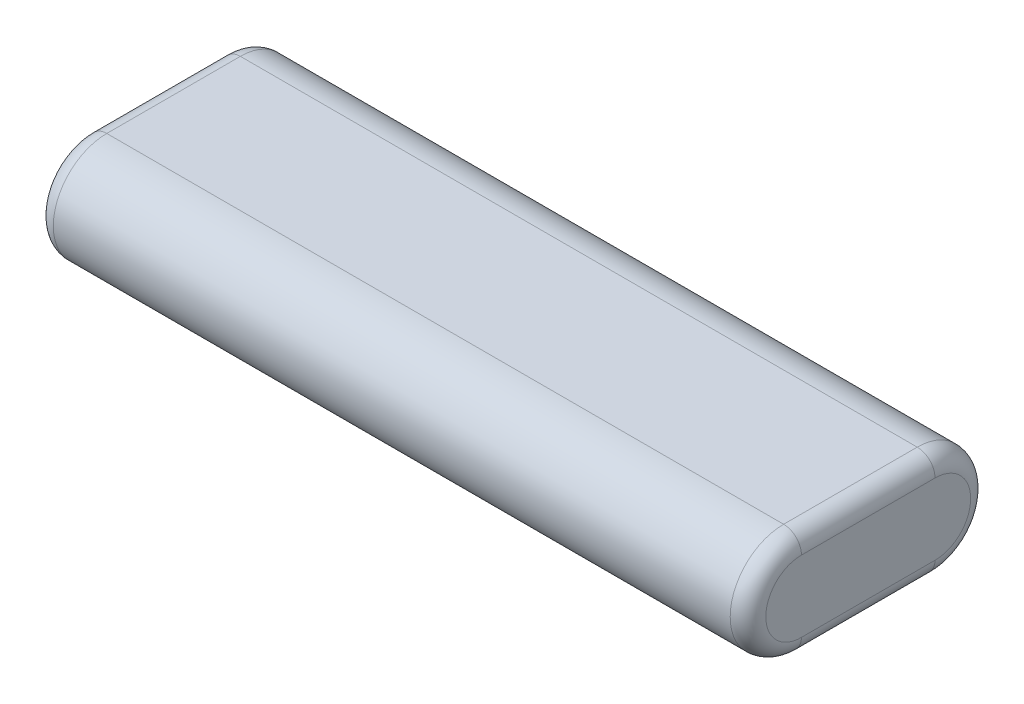
ISO-10303-21;
HEADER;
FILE_DESCRIPTION(('STEP AP214'),'2;1');
FILE_NAME('part.step','',(''),(''),'','','');
FILE_SCHEMA(('AUTOMOTIVE_DESIGN { 1 0 10303 214 1 1 1 1 }'));
ENDSEC;
DATA;
#1=APPLICATION_CONTEXT('core data for automotive mechanical design processes');
#2=APPLICATION_PROTOCOL_DEFINITION('international standard','automotive_design',2000,#1);
#3=PRODUCT_CONTEXT('',#1,'mechanical');
#4=PRODUCT('Part','Part','',(#3));
#5=PRODUCT_RELATED_PRODUCT_CATEGORY('part','',(#4));
#6=PRODUCT_DEFINITION_FORMATION('','',#4);
#7=PRODUCT_DEFINITION_CONTEXT('part definition',#1,'design');
#8=PRODUCT_DEFINITION('design','',#6,#7);
#9=PRODUCT_DEFINITION_SHAPE('','',#8);
#10=(LENGTH_UNIT() NAMED_UNIT(*) SI_UNIT(.MILLI.,.METRE.));
#11=(NAMED_UNIT(*) PLANE_ANGLE_UNIT() SI_UNIT($,.RADIAN.));
#12=(NAMED_UNIT(*) SI_UNIT($,.STERADIAN.) SOLID_ANGLE_UNIT());
#13=UNCERTAINTY_MEASURE_WITH_UNIT(LENGTH_MEASURE(1.E-05),#10,'distance_accuracy_value','');
#14=(GEOMETRIC_REPRESENTATION_CONTEXT(3) GLOBAL_UNCERTAINTY_ASSIGNED_CONTEXT((#13)) GLOBAL_UNIT_ASSIGNED_CONTEXT((#10,
#11,#12)) REPRESENTATION_CONTEXT('',''));
#15=CARTESIAN_POINT('',(0.,0.,0.));
#16=DIRECTION('',(0.,0.,1.));
#17=DIRECTION('',(1.,0.,0.));
#18=AXIS2_PLACEMENT_3D('',#15,#16,#17);
#19=CARTESIAN_POINT('',(63.5,0.,11.90625));
#20=DIRECTION('',(-1.,0.,0.));
#21=DIRECTION('',(0.,0.,1.));
#22=AXIS2_PLACEMENT_3D('',#19,#20,#21);
#23=CYLINDRICAL_SURFACE('',#22,9.525);
#24=DIRECTION('',(-1.,0.,0.));
#25=VECTOR('',#24,1.);
#26=CARTESIAN_POINT('',(63.5,9.525,11.90625));
#27=LINE('',#26,#25);
#28=CARTESIAN_POINT('',(60.325,9.525,11.90625));
#29=VERTEX_POINT('',#28);
#30=CARTESIAN_POINT('',(-60.325,9.525,11.90625));
#31=VERTEX_POINT('',#30);
#32=EDGE_CURVE('E142',#29,#31,#27,.T.);
#33=ORIENTED_EDGE('',*,*,#32,.T.);
#34=CARTESIAN_POINT('',(-60.325,0.,11.90625));
#35=DIRECTION('',(1.,0.,0.));
#36=DIRECTION('',(0.,0.,-1.));
#37=AXIS2_PLACEMENT_3D('',#34,#35,#36);
#38=CIRCLE('',#37,9.525);
#39=CARTESIAN_POINT('',(-60.325,-9.525,11.90625));
#40=VERTEX_POINT('',#39);
#41=EDGE_CURVE('E153',#31,#40,#38,.T.);
#42=ORIENTED_EDGE('',*,*,#41,.T.);
#43=DIRECTION('',(-1.,0.,0.));
#44=VECTOR('',#43,1.);
#45=CARTESIAN_POINT('',(63.5,-9.525,11.90625));
#46=LINE('',#45,#44);
#47=CARTESIAN_POINT('',(60.325,-9.525,11.90625));
#48=VERTEX_POINT('',#47);
#49=EDGE_CURVE('E124',#48,#40,#46,.T.);
#50=ORIENTED_EDGE('',*,*,#49,.F.);
#51=CARTESIAN_POINT('',(60.325,0.,11.90625));
#52=DIRECTION('',(1.,0.,0.));
#53=DIRECTION('',(0.,0.,-1.));
#54=AXIS2_PLACEMENT_3D('',#51,#52,#53);
#55=CIRCLE('',#54,9.525);
#56=EDGE_CURVE('E155',#48,#29,#55,.F.);
#57=ORIENTED_EDGE('',*,*,#56,.T.);
#58=EDGE_LOOP('',(#33,#42,#50,#57));
#59=FACE_BOUND('',#58,.T.);
#60=ADVANCED_FACE('F36',(#59),#23,.T.);
#61=CARTESIAN_POINT('',(63.5,-9.525,0.));
#62=DIRECTION('',(0.,1.,0.));
#63=DIRECTION('',(0.,0.,1.));
#64=AXIS2_PLACEMENT_3D('',#61,#62,#63);
#65=PLANE('',#64);
#66=ORIENTED_EDGE('',*,*,#49,.T.);
#67=DIRECTION('',(0.,0.,-1.));
#68=VECTOR('',#67,1.);
#69=CARTESIAN_POINT('',(-60.325,-9.525,0.));
#70=LINE('',#69,#68);
#71=CARTESIAN_POINT('',(-60.325,-9.525,-11.90625));
#72=VERTEX_POINT('',#71);
#73=EDGE_CURVE('E123',#40,#72,#70,.T.);
#74=ORIENTED_EDGE('',*,*,#73,.T.);
#75=DIRECTION('',(-1.,0.,0.));
#76=VECTOR('',#75,1.);
#77=CARTESIAN_POINT('',(63.5,-9.525,-11.90625));
#78=LINE('',#77,#76);
#79=CARTESIAN_POINT('',(60.325,-9.525,-11.90625));
#80=VERTEX_POINT('',#79);
#81=EDGE_CURVE('E105',#80,#72,#78,.T.);
#82=ORIENTED_EDGE('',*,*,#81,.F.);
#83=DIRECTION('',(0.,0.,-1.));
#84=VECTOR('',#83,1.);
#85=CARTESIAN_POINT('',(60.325,-9.525,11.90625));
#86=LINE('',#85,#84);
#87=EDGE_CURVE('E120',#80,#48,#86,.F.);
#88=ORIENTED_EDGE('',*,*,#87,.T.);
#89=EDGE_LOOP('',(#66,#74,#82,#88));
#90=FACE_BOUND('',#89,.T.);
#91=ADVANCED_FACE('F119',(#90),#65,.F.);
#92=CARTESIAN_POINT('',(63.5,0.,-11.90625));
#93=DIRECTION('',(-1.,0.,0.));
#94=DIRECTION('',(0.,0.,1.));
#95=AXIS2_PLACEMENT_3D('',#92,#93,#94);
#96=CYLINDRICAL_SURFACE('',#95,9.525);
#97=ORIENTED_EDGE('',*,*,#81,.T.);
#98=CARTESIAN_POINT('',(-60.325,0.,-11.90625));
#99=DIRECTION('',(1.,0.,0.));
#100=DIRECTION('',(0.,0.,-1.));
#101=AXIS2_PLACEMENT_3D('',#98,#99,#100);
#102=CIRCLE('',#101,9.525);
#103=CARTESIAN_POINT('',(-60.325,9.525,-11.90625));
#104=VERTEX_POINT('',#103);
#105=EDGE_CURVE('E112',#72,#104,#102,.T.);
#106=ORIENTED_EDGE('',*,*,#105,.T.);
#107=DIRECTION('',(-1.,0.,0.));
#108=VECTOR('',#107,1.);
#109=CARTESIAN_POINT('',(63.5,9.525,-11.90625));
#110=LINE('',#109,#108);
#111=CARTESIAN_POINT('',(60.325,9.525,-11.90625));
#112=VERTEX_POINT('',#111);
#113=EDGE_CURVE('E107',#112,#104,#110,.T.);
#114=ORIENTED_EDGE('',*,*,#113,.F.);
#115=CARTESIAN_POINT('',(60.325,0.,-11.90625));
#116=DIRECTION('',(1.,0.,0.));
#117=DIRECTION('',(0.,0.,-1.));
#118=AXIS2_PLACEMENT_3D('',#115,#116,#117);
#119=CIRCLE('',#118,9.525);
#120=EDGE_CURVE('E102',#112,#80,#119,.F.);
#121=ORIENTED_EDGE('',*,*,#120,.T.);
#122=EDGE_LOOP('',(#97,#106,#114,#121));
#123=FACE_BOUND('',#122,.T.);
#124=ADVANCED_FACE('F104',(#123),#96,.T.);
#125=CARTESIAN_POINT('',(63.5,9.525,0.));
#126=DIRECTION('',(0.,1.,0.));
#127=DIRECTION('',(0.,0.,1.));
#128=AXIS2_PLACEMENT_3D('',#125,#126,#127);
#129=PLANE('',#128);
#130=ORIENTED_EDGE('',*,*,#113,.T.);
#131=DIRECTION('',(0.,0.,-1.));
#132=VECTOR('',#131,1.);
#133=CARTESIAN_POINT('',(-60.325,9.525,11.90625));
#134=LINE('',#133,#132);
#135=EDGE_CURVE('E157',#104,#31,#134,.F.);
#136=ORIENTED_EDGE('',*,*,#135,.T.);
#137=ORIENTED_EDGE('',*,*,#32,.F.);
#138=DIRECTION('',(0.,0.,-1.));
#139=VECTOR('',#138,1.);
#140=CARTESIAN_POINT('',(60.325,9.525,0.));
#141=LINE('',#140,#139);
#142=EDGE_CURVE('E159',#29,#112,#141,.T.);
#143=ORIENTED_EDGE('',*,*,#142,.T.);
#144=EDGE_LOOP('',(#130,#136,#137,#143));
#145=FACE_BOUND('',#144,.T.);
#146=ADVANCED_FACE('F197',(#145),#129,.T.);
#147=CARTESIAN_POINT('',(63.5,0.,0.));
#148=DIRECTION('',(1.,0.,0.));
#149=DIRECTION('',(0.,0.,-1.));
#150=AXIS2_PLACEMENT_3D('',#147,#148,#149);
#151=PLANE('',#150);
#152=CARTESIAN_POINT('',(63.5,0.,-11.90625));
#153=DIRECTION('',(1.,0.,0.));
#154=DIRECTION('',(0.,0.,-1.));
#155=AXIS2_PLACEMENT_3D('',#152,#153,#154);
#156=CIRCLE('',#155,6.35);
#157=CARTESIAN_POINT('',(63.5,-6.35,-11.90625));
#158=VERTEX_POINT('',#157);
#159=CARTESIAN_POINT('',(63.5,6.35000000000001,-11.90625));
#160=VERTEX_POINT('',#159);
#161=EDGE_CURVE('E45',#158,#160,#156,.T.);
#162=ORIENTED_EDGE('',*,*,#161,.T.);
#163=DIRECTION('',(0.,0.,-1.));
#164=VECTOR('',#163,1.);
#165=CARTESIAN_POINT('',(63.5,6.35,0.));
#166=LINE('',#165,#164);
#167=CARTESIAN_POINT('',(63.5,6.35,11.90625));
#168=VERTEX_POINT('',#167);
#169=EDGE_CURVE('E11',#160,#168,#166,.F.);
#170=ORIENTED_EDGE('',*,*,#169,.T.);
#171=CARTESIAN_POINT('',(63.5,0.,11.90625));
#172=DIRECTION('',(1.,0.,0.));
#173=DIRECTION('',(0.,0.,-1.));
#174=AXIS2_PLACEMENT_3D('',#171,#172,#173);
#175=CIRCLE('',#174,6.35);
#176=CARTESIAN_POINT('',(63.5,-6.35,11.90625));
#177=VERTEX_POINT('',#176);
#178=EDGE_CURVE('E151',#168,#177,#175,.T.);
#179=ORIENTED_EDGE('',*,*,#178,.T.);
#180=DIRECTION('',(0.,0.,-1.));
#181=VECTOR('',#180,1.);
#182=CARTESIAN_POINT('',(63.5,-6.35,-11.90625));
#183=LINE('',#182,#181);
#184=EDGE_CURVE('E56',#177,#158,#183,.T.);
#185=ORIENTED_EDGE('',*,*,#184,.T.);
#186=EDGE_LOOP('',(#162,#170,#179,#185));
#187=FACE_BOUND('',#186,.T.);
#188=ADVANCED_FACE('F202',(#187),#151,.T.);
#189=CARTESIAN_POINT('',(-63.5,0.,0.));
#190=DIRECTION('',(1.,0.,0.));
#191=DIRECTION('',(0.,0.,-1.));
#192=AXIS2_PLACEMENT_3D('',#189,#190,#191);
#193=PLANE('',#192);
#194=CARTESIAN_POINT('',(-63.5,0.,-11.90625));
#195=DIRECTION('',(1.,0.,0.));
#196=DIRECTION('',(0.,0.,-1.));
#197=AXIS2_PLACEMENT_3D('',#194,#195,#196);
#198=CIRCLE('',#197,6.35);
#199=CARTESIAN_POINT('',(-63.5,6.35,-11.90625));
#200=VERTEX_POINT('',#199);
#201=CARTESIAN_POINT('',(-63.5,-6.35,-11.90625));
#202=VERTEX_POINT('',#201);
#203=EDGE_CURVE('E164',#200,#202,#198,.F.);
#204=ORIENTED_EDGE('',*,*,#203,.T.);
#205=DIRECTION('',(0.,0.,-1.));
#206=VECTOR('',#205,1.);
#207=CARTESIAN_POINT('',(-63.5,-6.35,0.));
#208=LINE('',#207,#206);
#209=CARTESIAN_POINT('',(-63.5,-6.35,11.90625));
#210=VERTEX_POINT('',#209);
#211=EDGE_CURVE('E113',#202,#210,#208,.F.);
#212=ORIENTED_EDGE('',*,*,#211,.T.);
#213=CARTESIAN_POINT('',(-63.5,0.,11.90625));
#214=DIRECTION('',(1.,0.,0.));
#215=DIRECTION('',(0.,0.,-1.));
#216=AXIS2_PLACEMENT_3D('',#213,#214,#215);
#217=CIRCLE('',#216,6.35);
#218=CARTESIAN_POINT('',(-63.5,6.35,11.90625));
#219=VERTEX_POINT('',#218);
#220=EDGE_CURVE('E168',#210,#219,#217,.F.);
#221=ORIENTED_EDGE('',*,*,#220,.T.);
#222=DIRECTION('',(0.,0.,-1.));
#223=VECTOR('',#222,1.);
#224=CARTESIAN_POINT('',(-63.5,6.35,-11.90625));
#225=LINE('',#224,#223);
#226=EDGE_CURVE('E166',#219,#200,#225,.T.);
#227=ORIENTED_EDGE('',*,*,#226,.T.);
#228=EDGE_LOOP('',(#204,#212,#221,#227));
#229=FACE_BOUND('',#228,.T.);
#230=ADVANCED_FACE('F227',(#229),#193,.F.);
#231=CARTESIAN_POINT('',(-60.325,6.35,0.));
#232=DIRECTION('',(0.,0.,1.));
#233=DIRECTION('',(0.,-1.,0.));
#234=AXIS2_PLACEMENT_3D('',#231,#232,#233);
#235=CYLINDRICAL_SURFACE('',#234,3.175);
#236=CARTESIAN_POINT('',(-60.325,6.35,-11.90625));
#237=DIRECTION('',(0.,0.,-1.));
#238=DIRECTION('',(-1.,0.,0.));
#239=AXIS2_PLACEMENT_3D('',#236,#237,#238);
#240=CIRCLE('',#239,3.175);
#241=EDGE_CURVE('E143',#200,#104,#240,.T.);
#242=ORIENTED_EDGE('',*,*,#241,.F.);
#243=ORIENTED_EDGE('',*,*,#226,.F.);
#244=CARTESIAN_POINT('',(-60.325,6.35,11.90625));
#245=DIRECTION('',(0.,0.,1.));
#246=DIRECTION('',(1.,0.,0.));
#247=AXIS2_PLACEMENT_3D('',#244,#245,#246);
#248=CIRCLE('',#247,3.175);
#249=EDGE_CURVE('E139',#31,#219,#248,.T.);
#250=ORIENTED_EDGE('',*,*,#249,.F.);
#251=ORIENTED_EDGE('',*,*,#135,.F.);
#252=EDGE_LOOP('',(#242,#243,#250,#251));
#253=FACE_BOUND('',#252,.T.);
#254=ADVANCED_FACE('F184',(#253),#235,.T.);
#255=CARTESIAN_POINT('',(-60.325,0.,11.90625));
#256=DIRECTION('',(1.,0.,0.));
#257=DIRECTION('',(0.,0.,-1.));
#258=AXIS2_PLACEMENT_3D('',#255,#256,#257);
#259=TOROIDAL_SURFACE('',#258,6.35,3.175);
#260=ORIENTED_EDGE('',*,*,#249,.T.);
#261=ORIENTED_EDGE('',*,*,#220,.F.);
#262=CARTESIAN_POINT('',(-60.325,-6.35,11.90625));
#263=DIRECTION('',(0.,0.,-1.));
#264=DIRECTION('',(-1.,0.,0.));
#265=AXIS2_PLACEMENT_3D('',#262,#263,#264);
#266=CIRCLE('',#265,3.175);
#267=EDGE_CURVE('E146',#40,#210,#266,.T.);
#268=ORIENTED_EDGE('',*,*,#267,.F.);
#269=ORIENTED_EDGE('',*,*,#41,.F.);
#270=EDGE_LOOP('',(#260,#261,#268,#269));
#271=FACE_BOUND('',#270,.T.);
#272=ADVANCED_FACE('F188',(#271),#259,.T.);
#273=CARTESIAN_POINT('',(-60.325,0.,-11.90625));
#274=DIRECTION('',(1.,0.,0.));
#275=DIRECTION('',(0.,0.,-1.));
#276=AXIS2_PLACEMENT_3D('',#273,#274,#275);
#277=TOROIDAL_SURFACE('',#276,6.35,3.175);
#278=ORIENTED_EDGE('',*,*,#241,.T.);
#279=ORIENTED_EDGE('',*,*,#105,.F.);
#280=CARTESIAN_POINT('',(-60.325,-6.35,-11.90625));
#281=DIRECTION('',(0.,0.,1.));
#282=DIRECTION('',(1.,0.,0.));
#283=AXIS2_PLACEMENT_3D('',#280,#281,#282);
#284=CIRCLE('',#283,3.175);
#285=EDGE_CURVE('E134',#202,#72,#284,.T.);
#286=ORIENTED_EDGE('',*,*,#285,.F.);
#287=ORIENTED_EDGE('',*,*,#203,.F.);
#288=EDGE_LOOP('',(#278,#279,#286,#287));
#289=FACE_BOUND('',#288,.T.);
#290=ADVANCED_FACE('F196',(#289),#277,.T.);
#291=CARTESIAN_POINT('',(-60.325,-6.35,0.));
#292=DIRECTION('',(0.,0.,-1.));
#293=DIRECTION('',(0.,1.,0.));
#294=AXIS2_PLACEMENT_3D('',#291,#292,#293);
#295=CYLINDRICAL_SURFACE('',#294,3.175);
#296=ORIENTED_EDGE('',*,*,#267,.T.);
#297=ORIENTED_EDGE('',*,*,#211,.F.);
#298=ORIENTED_EDGE('',*,*,#285,.T.);
#299=ORIENTED_EDGE('',*,*,#73,.F.);
#300=EDGE_LOOP('',(#296,#297,#298,#299));
#301=FACE_BOUND('',#300,.T.);
#302=ADVANCED_FACE('F191',(#301),#295,.T.);
#303=CARTESIAN_POINT('',(60.325,-6.35,0.));
#304=DIRECTION('',(0.,0.,1.));
#305=DIRECTION('',(0.,-1.,0.));
#306=AXIS2_PLACEMENT_3D('',#303,#304,#305);
#307=CYLINDRICAL_SURFACE('',#306,3.175);
#308=CARTESIAN_POINT('',(60.325,-6.35,-11.90625));
#309=DIRECTION('',(0.,0.,-1.));
#310=DIRECTION('',(-1.,0.,0.));
#311=AXIS2_PLACEMENT_3D('',#308,#309,#310);
#312=CIRCLE('',#311,3.175);
#313=EDGE_CURVE('E128',#158,#80,#312,.T.);
#314=ORIENTED_EDGE('',*,*,#313,.F.);
#315=ORIENTED_EDGE('',*,*,#184,.F.);
#316=CARTESIAN_POINT('',(60.325,-6.35,11.90625));
#317=DIRECTION('',(0.,0.,1.));
#318=DIRECTION('',(1.,0.,0.));
#319=AXIS2_PLACEMENT_3D('',#316,#317,#318);
#320=CIRCLE('',#319,3.175);
#321=EDGE_CURVE('E40',#48,#177,#320,.T.);
#322=ORIENTED_EDGE('',*,*,#321,.F.);
#323=ORIENTED_EDGE('',*,*,#87,.F.);
#324=EDGE_LOOP('',(#314,#315,#322,#323));
#325=FACE_BOUND('',#324,.T.);
#326=ADVANCED_FACE('F38',(#325),#307,.T.);
#327=CARTESIAN_POINT('',(60.325,0.,11.90625));
#328=DIRECTION('',(1.,0.,0.));
#329=DIRECTION('',(0.,0.,-1.));
#330=AXIS2_PLACEMENT_3D('',#327,#328,#329);
#331=TOROIDAL_SURFACE('',#330,6.35,3.175);
#332=ORIENTED_EDGE('',*,*,#321,.T.);
#333=ORIENTED_EDGE('',*,*,#178,.F.);
#334=CARTESIAN_POINT('',(60.325,6.35,11.90625));
#335=DIRECTION('',(0.,0.,-1.));
#336=DIRECTION('',(-1.,0.,0.));
#337=AXIS2_PLACEMENT_3D('',#334,#335,#336);
#338=CIRCLE('',#337,3.175);
#339=EDGE_CURVE('E133',#29,#168,#338,.T.);
#340=ORIENTED_EDGE('',*,*,#339,.F.);
#341=ORIENTED_EDGE('',*,*,#56,.F.);
#342=EDGE_LOOP('',(#332,#333,#340,#341));
#343=FACE_BOUND('',#342,.T.);
#344=ADVANCED_FACE('F204',(#343),#331,.T.);
#345=CARTESIAN_POINT('',(60.325,0.,-11.90625));
#346=DIRECTION('',(1.,0.,0.));
#347=DIRECTION('',(0.,0.,-1.));
#348=AXIS2_PLACEMENT_3D('',#345,#346,#347);
#349=TOROIDAL_SURFACE('',#348,6.35,3.175);
#350=ORIENTED_EDGE('',*,*,#313,.T.);
#351=ORIENTED_EDGE('',*,*,#120,.F.);
#352=CARTESIAN_POINT('',(60.325,6.35000000000001,-11.90625));
#353=DIRECTION('',(0.,0.,1.));
#354=DIRECTION('',(1.,0.,0.));
#355=AXIS2_PLACEMENT_3D('',#352,#353,#354);
#356=CIRCLE('',#355,3.175);
#357=EDGE_CURVE('E135',#160,#112,#356,.T.);
#358=ORIENTED_EDGE('',*,*,#357,.F.);
#359=ORIENTED_EDGE('',*,*,#161,.F.);
#360=EDGE_LOOP('',(#350,#351,#358,#359));
#361=FACE_BOUND('',#360,.T.);
#362=ADVANCED_FACE('F132',(#361),#349,.T.);
#363=CARTESIAN_POINT('',(60.325,6.35,0.));
#364=DIRECTION('',(0.,0.,-1.));
#365=DIRECTION('',(0.,1.,0.));
#366=AXIS2_PLACEMENT_3D('',#363,#364,#365);
#367=CYLINDRICAL_SURFACE('',#366,3.175);
#368=ORIENTED_EDGE('',*,*,#339,.T.);
#369=ORIENTED_EDGE('',*,*,#169,.F.);
#370=ORIENTED_EDGE('',*,*,#357,.T.);
#371=ORIENTED_EDGE('',*,*,#142,.F.);
#372=EDGE_LOOP('',(#368,#369,#370,#371));
#373=FACE_BOUND('',#372,.T.);
#374=ADVANCED_FACE('F200',(#373),#367,.T.);
#375=CLOSED_SHELL('',(#60,#91,#124,#146,#188,#230,#254,#272,#290,#302,#326,#344,#362,#374));
#376=MANIFOLD_SOLID_BREP('B2',#375);
#377=ADVANCED_BREP_SHAPE_REPRESENTATION('',(#18,#376),#14);
#378=SHAPE_DEFINITION_REPRESENTATION(#9,#377);
ENDSEC;
END-ISO-10303-21;
